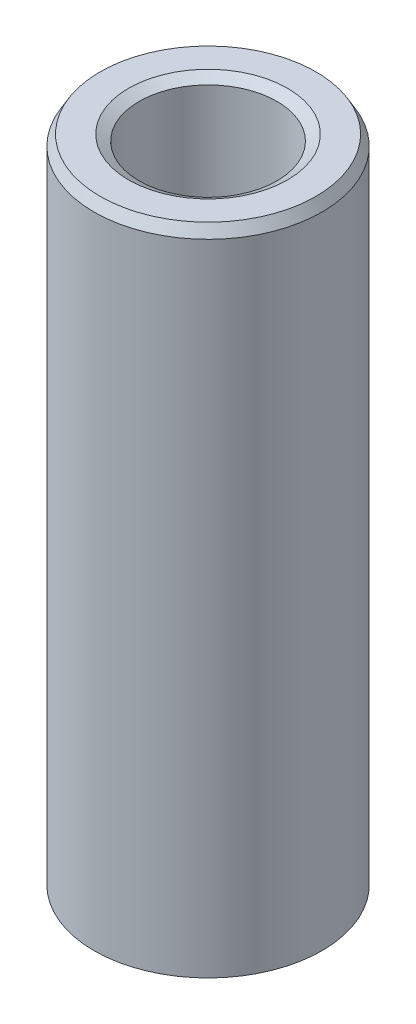
ISO-10303-21;
HEADER;
FILE_DESCRIPTION(('STEP AP214'),'2;1');
FILE_NAME('part.step','',(''),(''),'','','');
FILE_SCHEMA(('AUTOMOTIVE_DESIGN { 1 0 10303 214 1 1 1 1 }'));
ENDSEC;
DATA;
#1=APPLICATION_CONTEXT('core data for automotive mechanical design processes');
#2=APPLICATION_PROTOCOL_DEFINITION('international standard','automotive_design',2000,#1);
#3=PRODUCT_CONTEXT('',#1,'mechanical');
#4=PRODUCT('Part','Part','',(#3));
#5=PRODUCT_RELATED_PRODUCT_CATEGORY('part','',(#4));
#6=PRODUCT_DEFINITION_FORMATION('','',#4);
#7=PRODUCT_DEFINITION_CONTEXT('part definition',#1,'design');
#8=PRODUCT_DEFINITION('design','',#6,#7);
#9=PRODUCT_DEFINITION_SHAPE('','',#8);
#10=(LENGTH_UNIT() NAMED_UNIT(*) SI_UNIT(.MILLI.,.METRE.));
#11=(NAMED_UNIT(*) PLANE_ANGLE_UNIT() SI_UNIT($,.RADIAN.));
#12=(NAMED_UNIT(*) SI_UNIT($,.STERADIAN.) SOLID_ANGLE_UNIT());
#13=UNCERTAINTY_MEASURE_WITH_UNIT(LENGTH_MEASURE(1.E-05),#10,'distance_accuracy_value','');
#14=(GEOMETRIC_REPRESENTATION_CONTEXT(3) GLOBAL_UNCERTAINTY_ASSIGNED_CONTEXT((#13)) GLOBAL_UNIT_ASSIGNED_CONTEXT((#10,
#11,#12)) REPRESENTATION_CONTEXT('',''));
#15=CARTESIAN_POINT('',(0.,0.,0.));
#16=DIRECTION('',(0.,0.,1.));
#17=DIRECTION('',(1.,0.,0.));
#18=AXIS2_PLACEMENT_3D('',#15,#16,#17);
#19=CARTESIAN_POINT('',(0.,86.3655668525615,0.));
#20=DIRECTION('',(0.,-1.,0.));
#21=DIRECTION('',(0.,0.,-1.));
#22=AXIS2_PLACEMENT_3D('',#19,#20,#21);
#23=CYLINDRICAL_SURFACE('',#22,15.);
#24=CARTESIAN_POINT('',(0.,0.80092574561863,0.));
#25=DIRECTION('',(0.,1.,0.));
#26=DIRECTION('',(0.,0.,1.));
#27=AXIS2_PLACEMENT_3D('',#24,#25,#26);
#28=CIRCLE('',#27,15.);
#29=CARTESIAN_POINT('',(0.,0.80092574561863,15.));
#30=VERTEX_POINT('',#29);
#31=EDGE_CURVE('E10',#30,#30,#28,.T.);
#32=ORIENTED_EDGE('',*,*,#31,.T.);
#33=EDGE_LOOP('',(#32));
#34=FACE_BOUND('',#33,.T.);
#35=CARTESIAN_POINT('',(0.,84.97832276806,0.));
#36=DIRECTION('',(0.,1.,0.));
#37=DIRECTION('',(0.,0.,1.));
#38=AXIS2_PLACEMENT_3D('',#35,#36,#37);
#39=CIRCLE('',#38,15.);
#40=CARTESIAN_POINT('',(0.,84.97832276806,15.));
#41=VERTEX_POINT('',#40);
#42=EDGE_CURVE('E50',#41,#41,#39,.F.);
#43=ORIENTED_EDGE('',*,*,#42,.T.);
#44=EDGE_LOOP('',(#43));
#45=FACE_BOUND('',#44,.T.);
#46=ADVANCED_FACE('F39',(#34,#45),#23,.T.);
#47=CARTESIAN_POINT('',(0.,86.3655668525615,0.));
#48=DIRECTION('',(0.,1.,0.));
#49=DIRECTION('',(0.,0.,1.));
#50=AXIS2_PLACEMENT_3D('',#47,#48,#49);
#51=PLANE('',#50);
#52=CARTESIAN_POINT('',(0.,86.3655668525615,0.));
#53=DIRECTION('',(0.,1.,0.));
#54=DIRECTION('',(0.,0.,1.));
#55=AXIS2_PLACEMENT_3D('',#52,#53,#54);
#56=CIRCLE('',#55,10.454118286743);
#57=CARTESIAN_POINT('',(0.,86.3655668525615,10.454118286743));
#58=VERTEX_POINT('',#57);
#59=EDGE_CURVE('E58',#58,#58,#56,.F.);
#60=ORIENTED_EDGE('',*,*,#59,.T.);
#61=EDGE_LOOP('',(#60));
#62=FACE_BOUND('',#61,.T.);
#63=CARTESIAN_POINT('',(0.,86.3655668525615,0.));
#64=DIRECTION('',(0.,1.,0.));
#65=DIRECTION('',(0.,0.,1.));
#66=AXIS2_PLACEMENT_3D('',#63,#64,#65);
#67=CIRCLE('',#66,14.1990742543814);
#68=CARTESIAN_POINT('',(0.,86.3655668525615,14.1990742543814));
#69=VERTEX_POINT('',#68);
#70=EDGE_CURVE('E61',#69,#69,#67,.T.);
#71=ORIENTED_EDGE('',*,*,#70,.T.);
#72=EDGE_LOOP('',(#71));
#73=FACE_BOUND('',#72,.T.);
#74=ADVANCED_FACE('F88',(#62,#73),#51,.T.);
#75=CARTESIAN_POINT('',(0.,0.,0.));
#76=DIRECTION('',(0.,1.,0.));
#77=DIRECTION('',(0.,0.,1.));
#78=AXIS2_PLACEMENT_3D('',#75,#76,#77);
#79=PLANE('',#78);
#80=CARTESIAN_POINT('',(0.,0.,0.));
#81=DIRECTION('',(0.,1.,0.));
#82=DIRECTION('',(0.,0.,1.));
#83=AXIS2_PLACEMENT_3D('',#80,#81,#82);
#84=CIRCLE('',#83,9.86779994786016);
#85=CARTESIAN_POINT('',(0.,0.,9.86779994786016));
#86=VERTEX_POINT('',#85);
#87=EDGE_CURVE('E51',#86,#86,#84,.T.);
#88=ORIENTED_EDGE('',*,*,#87,.T.);
#89=EDGE_LOOP('',(#88));
#90=FACE_BOUND('',#89,.T.);
#91=CARTESIAN_POINT('',(0.,0.,0.));
#92=DIRECTION('',(0.,1.,0.));
#93=DIRECTION('',(0.,0.,1.));
#94=AXIS2_PLACEMENT_3D('',#91,#92,#93);
#95=CIRCLE('',#94,13.6127559154985);
#96=CARTESIAN_POINT('',(0.,0.,13.6127559154985));
#97=VERTEX_POINT('',#96);
#98=EDGE_CURVE('E54',#97,#97,#95,.F.);
#99=ORIENTED_EDGE('',*,*,#98,.T.);
#100=EDGE_LOOP('',(#99));
#101=FACE_BOUND('',#100,.T.);
#102=ADVANCED_FACE('F83',(#90,#101),#79,.F.);
#103=CARTESIAN_POINT('',(0.,86.3655668525615,0.));
#104=DIRECTION('',(0.,-1.,0.));
#105=DIRECTION('',(0.,0.,-1.));
#106=AXIS2_PLACEMENT_3D('',#103,#104,#105);
#107=CYLINDRICAL_SURFACE('',#106,9.06687420224154);
#108=CARTESIAN_POINT('',(0.,85.5646411069428,0.));
#109=DIRECTION('',(0.,1.,0.));
#110=DIRECTION('',(0.,0.,1.));
#111=AXIS2_PLACEMENT_3D('',#108,#109,#110);
#112=CIRCLE('',#111,9.06687420224154);
#113=CARTESIAN_POINT('',(0.,85.5646411069428,9.06687420224154));
#114=VERTEX_POINT('',#113);
#115=EDGE_CURVE('E67',#114,#114,#112,.T.);
#116=ORIENTED_EDGE('',*,*,#115,.T.);
#117=EDGE_LOOP('',(#116));
#118=FACE_BOUND('',#117,.T.);
#119=CARTESIAN_POINT('',(0.,1.38724408450146,0.));
#120=DIRECTION('',(0.,1.,0.));
#121=DIRECTION('',(0.,0.,1.));
#122=AXIS2_PLACEMENT_3D('',#119,#120,#121);
#123=CIRCLE('',#122,9.06687420224154);
#124=CARTESIAN_POINT('',(0.,1.38724408450146,9.06687420224154));
#125=VERTEX_POINT('',#124);
#126=EDGE_CURVE('E69',#125,#125,#123,.F.);
#127=ORIENTED_EDGE('',*,*,#126,.T.);
#128=EDGE_LOOP('',(#127));
#129=FACE_BOUND('',#128,.T.);
#130=ADVANCED_FACE('F71',(#118,#129),#107,.F.);
#131=CARTESIAN_POINT('',(0.,85.5646411069428,0.));
#132=DIRECTION('',(0.,1.,0.));
#133=DIRECTION('',(0.,0.,1.));
#134=AXIS2_PLACEMENT_3D('',#131,#132,#133);
#135=CONICAL_SURFACE('',#134,9.06687420224154,1.04719755119659);
#136=ORIENTED_EDGE('',*,*,#59,.F.);
#137=EDGE_LOOP('',(#136));
#138=FACE_BOUND('',#137,.T.);
#139=ORIENTED_EDGE('',*,*,#115,.F.);
#140=EDGE_LOOP('',(#139));
#141=FACE_BOUND('',#140,.T.);
#142=ADVANCED_FACE('F77',(#138,#141),#135,.F.);
#143=CARTESIAN_POINT('',(0.,0.,0.));
#144=DIRECTION('',(0.,-1.,0.));
#145=DIRECTION('',(0.,0.,-1.));
#146=AXIS2_PLACEMENT_3D('',#143,#144,#145);
#147=CONICAL_SURFACE('',#146,9.86779994786016,0.52359877559829);
#148=ORIENTED_EDGE('',*,*,#126,.F.);
#149=EDGE_LOOP('',(#148));
#150=FACE_BOUND('',#149,.T.);
#151=ORIENTED_EDGE('',*,*,#87,.F.);
#152=EDGE_LOOP('',(#151));
#153=FACE_BOUND('',#152,.T.);
#154=ADVANCED_FACE('F73',(#150,#153),#147,.F.);
#155=CARTESIAN_POINT('',(0.,0.80092574561863,0.));
#156=DIRECTION('',(0.,1.,0.));
#157=DIRECTION('',(0.,0.,1.));
#158=AXIS2_PLACEMENT_3D('',#155,#156,#157);
#159=CONICAL_SURFACE('',#158,15.,1.0471975511966);
#160=CARTESIAN_POINT('',(0.,0.,13.6127559154985));
#161=CARTESIAN_POINT('',(0.,0.00834297651686084,13.6272063747121));
#162=CARTESIAN_POINT('',(0.,0.0166859530337215,13.6416568339257));
#163=CARTESIAN_POINT('',(0.,0.0333719060674429,13.6705577523528));
#164=CARTESIAN_POINT('',(0.,0.0417148825843036,13.6850082115663));
#165=CARTESIAN_POINT('',(0.,0.058400835618025,13.7139091299934));
#166=CARTESIAN_POINT('',(0.,0.0667438121348857,13.728359589207));
#167=CARTESIAN_POINT('',(0.,0.0834297651686072,13.7572605076341));
#168=CARTESIAN_POINT('',(0.,0.091772741685468,13.7717109668477));
#169=CARTESIAN_POINT('',(0.,0.108458694719189,13.8006118852748));
#170=CARTESIAN_POINT('',(0.,0.11680167123605,13.8150623444883));
#171=CARTESIAN_POINT('',(0.,0.133487624269772,13.8439632629155));
#172=CARTESIAN_POINT('',(0.,0.141830600786632,13.858413722129));
#173=CARTESIAN_POINT('',(0.,0.158516553820354,13.8873146405561));
#174=CARTESIAN_POINT('',(0.,0.166859530337215,13.9017650997697));
#175=CARTESIAN_POINT('',(0.,0.183545483370936,13.9306660181968));
#176=CARTESIAN_POINT('',(0.,0.191888459887797,13.9451164774103));
#177=CARTESIAN_POINT('',(0.,0.208574412921518,13.9740173958375));
#178=CARTESIAN_POINT('',(0.,0.216917389438379,13.988467855051));
#179=CARTESIAN_POINT('',(0.,0.233603342472101,14.0173687734781));
#180=CARTESIAN_POINT('',(0.,0.241946318988961,14.0318192326917));
#181=CARTESIAN_POINT('',(0.,0.258632272022683,14.0607201511188));
#182=CARTESIAN_POINT('',(0.,0.266975248539543,14.0751706103324));
#183=CARTESIAN_POINT('',(0.,0.283661201573265,14.1040715287595));
#184=CARTESIAN_POINT('',(0.,0.292004178090126,14.118521987973));
#185=CARTESIAN_POINT('',(0.,0.308690131123847,14.1474229064001));
#186=CARTESIAN_POINT('',(0.,0.317033107640708,14.1618733656137));
#187=CARTESIAN_POINT('',(0.,0.333719060674429,14.1907742840408));
#188=CARTESIAN_POINT('',(0.,0.34206203719129,14.2052247432544));
#189=CARTESIAN_POINT('',(0.,0.358747990225012,14.2341256616815));
#190=CARTESIAN_POINT('',(0.,0.367090966741872,14.248576120895));
#191=CARTESIAN_POINT('',(0.,0.383776919775594,14.2774770393222));
#192=CARTESIAN_POINT('',(0.,0.392119896292454,14.2919274985357));
#193=CARTESIAN_POINT('',(0.,0.408805849326176,14.3208284169628));
#194=CARTESIAN_POINT('',(0.,0.417148825843036,14.3352788761764));
#195=CARTESIAN_POINT('',(0.,0.433834778876758,14.3641797946035));
#196=CARTESIAN_POINT('',(0.,0.442177755393619,14.3786302538171));
#197=CARTESIAN_POINT('',(0.,0.45886370842734,14.4075311722442));
#198=CARTESIAN_POINT('',(0.,0.467206684944201,14.4219816314577));
#199=CARTESIAN_POINT('',(0.,0.483892637977922,14.4508825498848));
#200=CARTESIAN_POINT('',(0.,0.492235614494783,14.4653330090984));
#201=CARTESIAN_POINT('',(0.,0.508921567528505,14.4942339275255));
#202=CARTESIAN_POINT('',(0.,0.517264544045365,14.5086843867391));
#203=CARTESIAN_POINT('',(0.,0.533950497079087,14.5375853051662));
#204=CARTESIAN_POINT('',(0.,0.542293473595948,14.5520357643797));
#205=CARTESIAN_POINT('',(0.,0.558979426629669,14.5809366828069));
#206=CARTESIAN_POINT('',(0.,0.56732240314653,14.5953871420204));
#207=CARTESIAN_POINT('',(0.,0.584008356180251,14.6242880604475));
#208=CARTESIAN_POINT('',(0.,0.592351332697112,14.6387385196611));
#209=CARTESIAN_POINT('',(0.,0.609037285730833,14.6676394380882));
#210=CARTESIAN_POINT('',(0.,0.617380262247694,14.6820898973017));
#211=CARTESIAN_POINT('',(0.,0.634066215281415,14.7109908157289));
#212=CARTESIAN_POINT('',(0.,0.642409191798276,14.7254412749424));
#213=CARTESIAN_POINT('',(0.,0.659095144831998,14.7543421933695));
#214=CARTESIAN_POINT('',(0.,0.667438121348858,14.7687926525831));
#215=CARTESIAN_POINT('',(0.,0.68412407438258,14.7976935710102));
#216=CARTESIAN_POINT('',(0.,0.692467050899441,14.8121440302238));
#217=CARTESIAN_POINT('',(0.,0.709153003933162,14.8410449486509));
#218=CARTESIAN_POINT('',(0.,0.717495980450023,14.8554954078644));
#219=CARTESIAN_POINT('',(0.,0.734181933483744,14.8843963262915));
#220=CARTESIAN_POINT('',(0.,0.742524910000605,14.8988467855051));
#221=CARTESIAN_POINT('',(0.,0.759210863034327,14.9277477039322));
#222=CARTESIAN_POINT('',(0.,0.767553839551187,14.9421981631458));
#223=CARTESIAN_POINT('',(0.,0.784239792584909,14.9710990815729));
#224=CARTESIAN_POINT('',(0.,0.792582769101769,14.9855495407864));
#225=CARTESIAN_POINT('',(0.,0.80092574561863,15.));
#226=B_SPLINE_CURVE_WITH_KNOTS('',3,(#160,#161,#162,#163,#164,#165,#166,#167,#168,#169,#170,
#171,#172,#173,#174,#175,#176,#177,#178,#179,#180,#181,#182,#183,#184,#185,#186,#187,#188,#189,
#190,#191,#192,#193,#194,#195,#196,#197,#198,#199,#200,#201,#202,#203,#204,#205,#206,#207,#208,
#209,#210,#211,#212,#213,#214,#215,#216,#217,#218,#219,#220,#221,#222,#223,#224,#225),
.UNSPECIFIED.,.F.,.F.,(4,2,2,2,2,2,2,2,2,2,2,2,2,2,2,2,2,2,2,2,2,2,2,2,2,2,2,2,2,2,2,2,4),(0.,
0.0500578591011634,0.100115718202328,0.150173577303493,0.200231436404658,0.250289295505823,
0.300347154606986,0.350405013708151,0.400462872809316,0.450520731910479,0.500578591011644,
0.550636450112809,0.600694309213974,0.650752168315139,0.700810027416302,0.750867886517467,
0.800925745618632,0.850983604719796,0.90104146382096,0.951099322922125,1.00115718202329,
1.05121504112445,1.10127290022562,1.15133075932678,1.20138861842795,1.25144647752911,
1.30150433663028,1.35156219573144,1.4016200548326,1.45167791393377,1.50173577303493,
1.5517936321361,1.60185149123726),.UNSPECIFIED.);
#227=EDGE_CURVE('BSEAM76',#97,#30,#226,.T.);
#228=ORIENTED_EDGE('',*,*,#98,.F.);
#229=ORIENTED_EDGE('',*,*,#31,.F.);
#230=ORIENTED_EDGE('',*,*,#227,.T.);
#231=ORIENTED_EDGE('',*,*,#227,.F.);
#232=EDGE_LOOP('',(#228,#230,#229,#231));
#233=FACE_BOUND('',#232,.T.);
#234=ADVANCED_FACE('F76',(#233),#159,.T.);
#235=CARTESIAN_POINT('',(0.,86.3655668525615,0.));
#236=DIRECTION('',(0.,-1.,0.));
#237=DIRECTION('',(0.,0.,-1.));
#238=AXIS2_PLACEMENT_3D('',#235,#236,#237);
#239=CONICAL_SURFACE('',#238,14.1990742543814,0.523598775598287);
#240=ORIENTED_EDGE('',*,*,#42,.F.);
#241=EDGE_LOOP('',(#240));
#242=FACE_BOUND('',#241,.T.);
#243=ORIENTED_EDGE('',*,*,#70,.F.);
#244=EDGE_LOOP('',(#243));
#245=FACE_BOUND('',#244,.T.);
#246=ADVANCED_FACE('F45',(#242,#245),#239,.T.);
#247=CLOSED_SHELL('',(#46,#74,#102,#130,#142,#154,#234,#246));
#248=MANIFOLD_SOLID_BREP('B2',#247);
#249=ADVANCED_BREP_SHAPE_REPRESENTATION('',(#18,#248),#14);
#250=SHAPE_DEFINITION_REPRESENTATION(#9,#249);
ENDSEC;
END-ISO-10303-21;
